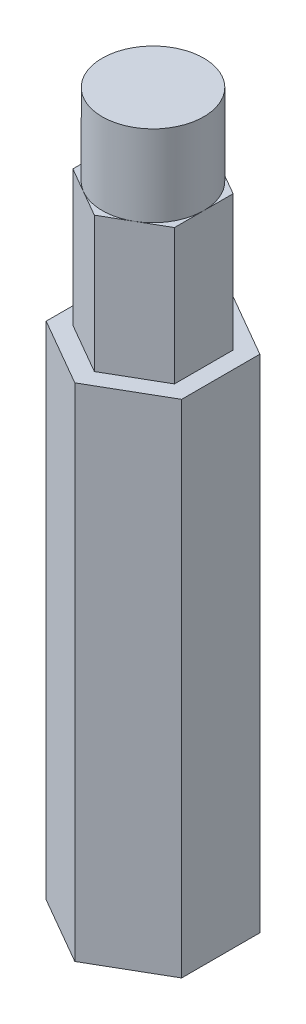
ISO-10303-21;
HEADER;
FILE_DESCRIPTION(('STEP AP214'),'2;1');
FILE_NAME('part.step','',(''),(''),'','','');
FILE_SCHEMA(('AUTOMOTIVE_DESIGN { 1 0 10303 214 1 1 1 1 }'));
ENDSEC;
DATA;
#1=APPLICATION_CONTEXT('core data for automotive mechanical design processes');
#2=APPLICATION_PROTOCOL_DEFINITION('international standard','automotive_design',2000,#1);
#3=PRODUCT_CONTEXT('',#1,'mechanical');
#4=PRODUCT('Part','Part','',(#3));
#5=PRODUCT_RELATED_PRODUCT_CATEGORY('part','',(#4));
#6=PRODUCT_DEFINITION_FORMATION('','',#4);
#7=PRODUCT_DEFINITION_CONTEXT('part definition',#1,'design');
#8=PRODUCT_DEFINITION('design','',#6,#7);
#9=PRODUCT_DEFINITION_SHAPE('','',#8);
#10=(LENGTH_UNIT() NAMED_UNIT(*) SI_UNIT(.MILLI.,.METRE.));
#11=(NAMED_UNIT(*) PLANE_ANGLE_UNIT() SI_UNIT($,.RADIAN.));
#12=(NAMED_UNIT(*) SI_UNIT($,.STERADIAN.) SOLID_ANGLE_UNIT());
#13=UNCERTAINTY_MEASURE_WITH_UNIT(LENGTH_MEASURE(1.E-05),#10,'distance_accuracy_value','');
#14=(GEOMETRIC_REPRESENTATION_CONTEXT(3) GLOBAL_UNCERTAINTY_ASSIGNED_CONTEXT((#13)) GLOBAL_UNIT_ASSIGNED_CONTEXT((#10,
#11,#12)) REPRESENTATION_CONTEXT('',''));
#15=CARTESIAN_POINT('',(0.,0.,0.));
#16=DIRECTION('',(0.,0.,1.));
#17=DIRECTION('',(1.,0.,0.));
#18=AXIS2_PLACEMENT_3D('',#15,#16,#17);
#19=CARTESIAN_POINT('',(0.,59.69,0.));
#20=DIRECTION('',(0.,1.,0.));
#21=DIRECTION('',(0.,0.,1.));
#22=AXIS2_PLACEMENT_3D('',#19,#20,#21);
#23=PLANE('',#22);
#24=DIRECTION('',(-0.866025403784439,0.,0.5));
#25=VECTOR('',#24,1.);
#26=CARTESIAN_POINT('',(0.,59.69,-5.49926131403119));
#27=LINE('',#26,#25);
#28=CARTESIAN_POINT('',(-2.38125,59.69,-4.12444598552339));
#29=VERTEX_POINT('',#28);
#30=CARTESIAN_POINT('',(-4.7625,59.69,-2.74963065701559));
#31=VERTEX_POINT('',#30);
#32=EDGE_CURVE('E187',#29,#31,#27,.T.);
#33=ORIENTED_EDGE('',*,*,#32,.T.);
#34=DIRECTION('',(0.,0.,1.));
#35=VECTOR('',#34,1.);
#36=CARTESIAN_POINT('',(-4.7625,59.69,-2.74963065701559));
#37=LINE('',#36,#35);
#38=CARTESIAN_POINT('',(-4.7625,59.69,0.));
#39=VERTEX_POINT('',#38);
#40=EDGE_CURVE('E192',#31,#39,#37,.T.);
#41=ORIENTED_EDGE('',*,*,#40,.T.);
#42=CARTESIAN_POINT('',(0.,59.69,0.));
#43=DIRECTION('',(0.,1.,0.));
#44=DIRECTION('',(0.,0.,1.));
#45=AXIS2_PLACEMENT_3D('',#42,#43,#44);
#46=CIRCLE('',#45,4.7625);
#47=EDGE_CURVE('E222',#39,#29,#46,.F.);
#48=ORIENTED_EDGE('',*,*,#47,.T.);
#49=EDGE_LOOP('',(#33,#41,#48));
#50=FACE_BOUND('',#49,.T.);
#51=ADVANCED_FACE('F33',(#50),#23,.T.);
#52=CARTESIAN_POINT('',(-2.38125,59.69,4.12444598552339));
#53=VERTEX_POINT('',#52);
#54=EDGE_CURVE('E218',#53,#39,#46,.F.);
#55=ORIENTED_EDGE('',*,*,#54,.T.);
#56=CARTESIAN_POINT('',(-4.7625,59.69,2.74963065701559));
#57=VERTEX_POINT('',#56);
#58=EDGE_CURVE('E191',#39,#57,#37,.T.);
#59=ORIENTED_EDGE('',*,*,#58,.T.);
#60=DIRECTION('',(0.866025403784439,0.,0.5));
#61=VECTOR('',#60,1.);
#62=CARTESIAN_POINT('',(-4.7625,59.69,2.74963065701559));
#63=LINE('',#62,#61);
#64=EDGE_CURVE('E165',#57,#53,#63,.T.);
#65=ORIENTED_EDGE('',*,*,#64,.T.);
#66=EDGE_LOOP('',(#55,#59,#65));
#67=FACE_BOUND('',#66,.T.);
#68=ADVANCED_FACE('F281',(#67),#23,.T.);
#69=CARTESIAN_POINT('',(2.38125,59.69,4.12444598552339));
#70=VERTEX_POINT('',#69);
#71=EDGE_CURVE('E217',#70,#53,#46,.F.);
#72=ORIENTED_EDGE('',*,*,#71,.T.);
#73=CARTESIAN_POINT('',(0.,59.69,5.49926131403119));
#74=VERTEX_POINT('',#73);
#75=EDGE_CURVE('E168',#53,#74,#63,.T.);
#76=ORIENTED_EDGE('',*,*,#75,.T.);
#77=DIRECTION('',(0.866025403784439,0.,-0.5));
#78=VECTOR('',#77,1.);
#79=CARTESIAN_POINT('',(0.,59.69,5.49926131403119));
#80=LINE('',#79,#78);
#81=EDGE_CURVE('E179',#74,#70,#80,.T.);
#82=ORIENTED_EDGE('',*,*,#81,.T.);
#83=EDGE_LOOP('',(#72,#76,#82));
#84=FACE_BOUND('',#83,.T.);
#85=ADVANCED_FACE('F288',(#84),#23,.T.);
#86=DIRECTION('',(-0.866025403784439,0.,-0.5));
#87=VECTOR('',#86,1.);
#88=CARTESIAN_POINT('',(4.7625,59.69,-2.7496306570156));
#89=LINE('',#88,#87);
#90=CARTESIAN_POINT('',(2.38125,59.69,-4.12444598552339));
#91=VERTEX_POINT('',#90);
#92=CARTESIAN_POINT('',(0.,59.69,-5.49926131403119));
#93=VERTEX_POINT('',#92);
#94=EDGE_CURVE('E185',#91,#93,#89,.T.);
#95=ORIENTED_EDGE('',*,*,#94,.T.);
#96=EDGE_CURVE('E188',#93,#29,#27,.T.);
#97=ORIENTED_EDGE('',*,*,#96,.T.);
#98=EDGE_CURVE('E318',#29,#91,#46,.F.);
#99=ORIENTED_EDGE('',*,*,#98,.T.);
#100=EDGE_LOOP('',(#95,#97,#99));
#101=FACE_BOUND('',#100,.T.);
#102=ADVANCED_FACE('F303',(#101),#23,.T.);
#103=CARTESIAN_POINT('',(4.7625,59.69,0.));
#104=VERTEX_POINT('',#103);
#105=EDGE_CURVE('E311',#104,#70,#46,.F.);
#106=ORIENTED_EDGE('',*,*,#105,.T.);
#107=CARTESIAN_POINT('',(4.7625,59.69,2.74963065701559));
#108=VERTEX_POINT('',#107);
#109=EDGE_CURVE('E183',#70,#108,#80,.T.);
#110=ORIENTED_EDGE('',*,*,#109,.T.);
#111=DIRECTION('',(0.,0.,-1.));
#112=VECTOR('',#111,1.);
#113=CARTESIAN_POINT('',(4.7625,59.69,2.74963065701559));
#114=LINE('',#113,#112);
#115=EDGE_CURVE('E145',#108,#104,#114,.T.);
#116=ORIENTED_EDGE('',*,*,#115,.T.);
#117=EDGE_LOOP('',(#106,#110,#116));
#118=FACE_BOUND('',#117,.T.);
#119=ADVANCED_FACE('F295',(#118),#23,.T.);
#120=CARTESIAN_POINT('',(4.7625,59.69,-2.7496306570156));
#121=VERTEX_POINT('',#120);
#122=EDGE_CURVE('E182',#104,#121,#114,.T.);
#123=ORIENTED_EDGE('',*,*,#122,.T.);
#124=EDGE_CURVE('E56',#121,#91,#89,.T.);
#125=ORIENTED_EDGE('',*,*,#124,.T.);
#126=EDGE_CURVE('E308',#91,#104,#46,.F.);
#127=ORIENTED_EDGE('',*,*,#126,.T.);
#128=EDGE_LOOP('',(#123,#125,#127));
#129=FACE_BOUND('',#128,.T.);
#130=ADVANCED_FACE('F284',(#129),#23,.T.);
#131=CARTESIAN_POINT('',(0.,67.31,0.));
#132=DIRECTION('',(0.,-1.,0.));
#133=DIRECTION('',(0.,0.,-1.));
#134=AXIS2_PLACEMENT_3D('',#131,#132,#133);
#135=CYLINDRICAL_SURFACE('',#134,4.7625);
#136=ORIENTED_EDGE('',*,*,#54,.F.);
#137=ORIENTED_EDGE('',*,*,#71,.F.);
#138=ORIENTED_EDGE('',*,*,#105,.F.);
#139=ORIENTED_EDGE('',*,*,#126,.F.);
#140=ORIENTED_EDGE('',*,*,#98,.F.);
#141=ORIENTED_EDGE('',*,*,#47,.F.);
#142=EDGE_LOOP('',(#136,#137,#138,#139,#140,#141));
#143=FACE_BOUND('',#142,.T.);
#144=CARTESIAN_POINT('',(0.,67.31,0.));
#145=DIRECTION('',(0.,1.,0.));
#146=DIRECTION('',(0.,0.,1.));
#147=AXIS2_PLACEMENT_3D('',#144,#145,#146);
#148=CIRCLE('',#147,4.7625);
#149=CARTESIAN_POINT('',(0.,67.31,4.7625));
#150=VERTEX_POINT('',#149);
#151=EDGE_CURVE('E214',#150,#150,#148,.T.);
#152=ORIENTED_EDGE('',*,*,#151,.F.);
#153=EDGE_LOOP('',(#152));
#154=FACE_BOUND('',#153,.T.);
#155=ADVANCED_FACE('F294',(#143,#154),#135,.T.);
#156=CARTESIAN_POINT('',(0.,67.31,0.));
#157=DIRECTION('',(0.,1.,0.));
#158=DIRECTION('',(0.,0.,1.));
#159=AXIS2_PLACEMENT_3D('',#156,#157,#158);
#160=PLANE('',#159);
#161=ORIENTED_EDGE('',*,*,#151,.T.);
#162=EDGE_LOOP('',(#161));
#163=FACE_BOUND('',#162,.T.);
#164=ADVANCED_FACE('F301',(#163),#160,.T.);
#165=CARTESIAN_POINT('',(0.,46.99,0.));
#166=DIRECTION('',(0.,1.,0.));
#167=DIRECTION('',(0.,0.,1.));
#168=AXIS2_PLACEMENT_3D('',#165,#166,#167);
#169=PLANE('',#168);
#170=DIRECTION('',(0.866025403784439,0.,0.5));
#171=VECTOR('',#170,1.);
#172=CARTESIAN_POINT('',(-4.7625,46.99,2.74963065701559));
#173=LINE('',#172,#171);
#174=CARTESIAN_POINT('',(-4.7625,46.99,2.74963065701559));
#175=VERTEX_POINT('',#174);
#176=CARTESIAN_POINT('',(0.,46.99,5.49926131403119));
#177=VERTEX_POINT('',#176);
#178=EDGE_CURVE('E150',#175,#177,#173,.T.);
#179=ORIENTED_EDGE('',*,*,#178,.F.);
#180=DIRECTION('',(0.,0.,1.));
#181=VECTOR('',#180,1.);
#182=CARTESIAN_POINT('',(-4.7625,46.99,-2.74963065701559));
#183=LINE('',#182,#181);
#184=CARTESIAN_POINT('',(-4.7625,46.99,-2.74963065701559));
#185=VERTEX_POINT('',#184);
#186=EDGE_CURVE('E175',#185,#175,#183,.T.);
#187=ORIENTED_EDGE('',*,*,#186,.F.);
#188=DIRECTION('',(-0.866025403784439,0.,0.5));
#189=VECTOR('',#188,1.);
#190=CARTESIAN_POINT('',(0.,46.99,-5.49926131403119));
#191=LINE('',#190,#189);
#192=CARTESIAN_POINT('',(0.,46.99,-5.49926131403119));
#193=VERTEX_POINT('',#192);
#194=EDGE_CURVE('E172',#193,#185,#191,.T.);
#195=ORIENTED_EDGE('',*,*,#194,.F.);
#196=DIRECTION('',(-0.866025403784439,0.,-0.5));
#197=VECTOR('',#196,1.);
#198=CARTESIAN_POINT('',(4.7625,46.99,-2.7496306570156));
#199=LINE('',#198,#197);
#200=CARTESIAN_POINT('',(4.7625,46.99,-2.7496306570156));
#201=VERTEX_POINT('',#200);
#202=EDGE_CURVE('E160',#201,#193,#199,.T.);
#203=ORIENTED_EDGE('',*,*,#202,.F.);
#204=DIRECTION('',(0.,0.,-1.));
#205=VECTOR('',#204,1.);
#206=CARTESIAN_POINT('',(4.7625,46.99,2.74963065701559));
#207=LINE('',#206,#205);
#208=CARTESIAN_POINT('',(4.7625,46.99,2.74963065701559));
#209=VERTEX_POINT('',#208);
#210=EDGE_CURVE('E143',#209,#201,#207,.T.);
#211=ORIENTED_EDGE('',*,*,#210,.F.);
#212=DIRECTION('',(0.866025403784439,0.,-0.5));
#213=VECTOR('',#212,1.);
#214=CARTESIAN_POINT('',(0.,46.99,5.49926131403119));
#215=LINE('',#214,#213);
#216=EDGE_CURVE('E156',#177,#209,#215,.T.);
#217=ORIENTED_EDGE('',*,*,#216,.F.);
#218=EDGE_LOOP('',(#179,#187,#195,#203,#211,#217));
#219=FACE_BOUND('',#218,.T.);
#220=DIRECTION('',(0.866025403784439,0.,0.5));
#221=VECTOR('',#220,1.);
#222=CARTESIAN_POINT('',(-6.35,46.99,3.66617420935412));
#223=LINE('',#222,#221);
#224=CARTESIAN_POINT('',(-6.35,46.99,3.66617420935412));
#225=VERTEX_POINT('',#224);
#226=CARTESIAN_POINT('',(0.,46.99,7.33234841870825));
#227=VERTEX_POINT('',#226);
#228=EDGE_CURVE('E196',#225,#227,#223,.T.);
#229=ORIENTED_EDGE('',*,*,#228,.T.);
#230=DIRECTION('',(0.866025403784438,0.,-0.5));
#231=VECTOR('',#230,1.);
#232=CARTESIAN_POINT('',(0.,46.99,7.33234841870825));
#233=LINE('',#232,#231);
#234=CARTESIAN_POINT('',(6.35,46.99,3.66617420935412));
#235=VERTEX_POINT('',#234);
#236=EDGE_CURVE('E205',#227,#235,#233,.T.);
#237=ORIENTED_EDGE('',*,*,#236,.T.);
#238=DIRECTION('',(0.,0.,-1.));
#239=VECTOR('',#238,1.);
#240=CARTESIAN_POINT('',(6.35,46.99,3.66617420935412));
#241=LINE('',#240,#239);
#242=CARTESIAN_POINT('',(6.35,46.99,-3.66617420935412));
#243=VERTEX_POINT('',#242);
#244=EDGE_CURVE('E207',#235,#243,#241,.T.);
#245=ORIENTED_EDGE('',*,*,#244,.T.);
#246=DIRECTION('',(-0.866025403784439,0.,-0.5));
#247=VECTOR('',#246,1.);
#248=CARTESIAN_POINT('',(6.35,46.99,-3.66617420935412));
#249=LINE('',#248,#247);
#250=CARTESIAN_POINT('',(0.,46.99,-7.33234841870825));
#251=VERTEX_POINT('',#250);
#252=EDGE_CURVE('E209',#243,#251,#249,.T.);
#253=ORIENTED_EDGE('',*,*,#252,.T.);
#254=DIRECTION('',(-0.866025403784438,0.,0.5));
#255=VECTOR('',#254,1.);
#256=CARTESIAN_POINT('',(0.,46.99,-7.33234841870825));
#257=LINE('',#256,#255);
#258=CARTESIAN_POINT('',(-6.35,46.99,-3.66617420935412));
#259=VERTEX_POINT('',#258);
#260=EDGE_CURVE('E211',#251,#259,#257,.T.);
#261=ORIENTED_EDGE('',*,*,#260,.T.);
#262=DIRECTION('',(0.,0.,1.));
#263=VECTOR('',#262,1.);
#264=CARTESIAN_POINT('',(-6.35,46.99,-3.66617420935412));
#265=LINE('',#264,#263);
#266=EDGE_CURVE('E48',#259,#225,#265,.T.);
#267=ORIENTED_EDGE('',*,*,#266,.T.);
#268=EDGE_LOOP('',(#229,#237,#245,#253,#261,#267));
#269=FACE_BOUND('',#268,.T.);
#270=ADVANCED_FACE('F155',(#219,#269),#169,.T.);
#271=CARTESIAN_POINT('',(0.,46.99,5.49926131403119));
#272=DIRECTION('',(0.5,0.,0.866025403784439));
#273=DIRECTION('',(0.866025403784439,0.,-0.5));
#274=AXIS2_PLACEMENT_3D('',#271,#272,#273);
#275=PLANE('',#274);
#276=ORIENTED_EDGE('',*,*,#81,.F.);
#277=DIRECTION('',(0.,1.,0.));
#278=VECTOR('',#277,1.);
#279=CARTESIAN_POINT('',(0.,46.99,5.49926131403119));
#280=LINE('',#279,#278);
#281=EDGE_CURVE('E164',#177,#74,#280,.T.);
#282=ORIENTED_EDGE('',*,*,#281,.F.);
#283=ORIENTED_EDGE('',*,*,#216,.T.);
#284=DIRECTION('',(0.,1.,0.));
#285=VECTOR('',#284,1.);
#286=CARTESIAN_POINT('',(4.7625,46.99,2.74963065701559));
#287=LINE('',#286,#285);
#288=EDGE_CURVE('E140',#209,#108,#287,.T.);
#289=ORIENTED_EDGE('',*,*,#288,.T.);
#290=ORIENTED_EDGE('',*,*,#109,.F.);
#291=EDGE_LOOP('',(#276,#282,#283,#289,#290));
#292=FACE_BOUND('',#291,.T.);
#293=ADVANCED_FACE('F163',(#292),#275,.T.);
#294=CARTESIAN_POINT('',(-4.7625,46.99,2.74963065701559));
#295=DIRECTION('',(-0.5,0.,0.866025403784439));
#296=DIRECTION('',(0.866025403784439,0.,0.5));
#297=AXIS2_PLACEMENT_3D('',#294,#295,#296);
#298=PLANE('',#297);
#299=ORIENTED_EDGE('',*,*,#64,.F.);
#300=DIRECTION('',(0.,1.,0.));
#301=VECTOR('',#300,1.);
#302=CARTESIAN_POINT('',(-4.7625,46.99,2.74963065701559));
#303=LINE('',#302,#301);
#304=EDGE_CURVE('E197',#175,#57,#303,.T.);
#305=ORIENTED_EDGE('',*,*,#304,.F.);
#306=ORIENTED_EDGE('',*,*,#178,.T.);
#307=ORIENTED_EDGE('',*,*,#281,.T.);
#308=ORIENTED_EDGE('',*,*,#75,.F.);
#309=EDGE_LOOP('',(#299,#305,#306,#307,#308));
#310=FACE_BOUND('',#309,.T.);
#311=ADVANCED_FACE('F326',(#310),#298,.T.);
#312=CARTESIAN_POINT('',(-4.7625,46.99,-2.74963065701559));
#313=DIRECTION('',(-1.,0.,0.));
#314=DIRECTION('',(0.,0.,1.));
#315=AXIS2_PLACEMENT_3D('',#312,#313,#314);
#316=PLANE('',#315);
#317=ORIENTED_EDGE('',*,*,#40,.F.);
#318=DIRECTION('',(0.,1.,0.));
#319=VECTOR('',#318,1.);
#320=CARTESIAN_POINT('',(-4.7625,46.99,-2.74963065701559));
#321=LINE('',#320,#319);
#322=EDGE_CURVE('E199',#185,#31,#321,.T.);
#323=ORIENTED_EDGE('',*,*,#322,.F.);
#324=ORIENTED_EDGE('',*,*,#186,.T.);
#325=ORIENTED_EDGE('',*,*,#304,.T.);
#326=ORIENTED_EDGE('',*,*,#58,.F.);
#327=EDGE_LOOP('',(#317,#323,#324,#325,#326));
#328=FACE_BOUND('',#327,.T.);
#329=ADVANCED_FACE('F330',(#328),#316,.T.);
#330=CARTESIAN_POINT('',(0.,46.99,-5.49926131403119));
#331=DIRECTION('',(-0.5,0.,-0.866025403784439));
#332=DIRECTION('',(-0.866025403784439,0.,0.5));
#333=AXIS2_PLACEMENT_3D('',#330,#331,#332);
#334=PLANE('',#333);
#335=ORIENTED_EDGE('',*,*,#96,.F.);
#336=DIRECTION('',(0.,1.,0.));
#337=VECTOR('',#336,1.);
#338=CARTESIAN_POINT('',(0.,46.99,-5.49926131403119));
#339=LINE('',#338,#337);
#340=EDGE_CURVE('E201',#193,#93,#339,.T.);
#341=ORIENTED_EDGE('',*,*,#340,.F.);
#342=ORIENTED_EDGE('',*,*,#194,.T.);
#343=ORIENTED_EDGE('',*,*,#322,.T.);
#344=ORIENTED_EDGE('',*,*,#32,.F.);
#345=EDGE_LOOP('',(#335,#341,#342,#343,#344));
#346=FACE_BOUND('',#345,.T.);
#347=ADVANCED_FACE('F333',(#346),#334,.T.);
#348=CARTESIAN_POINT('',(4.7625,46.99,-2.7496306570156));
#349=DIRECTION('',(0.5,0.,-0.866025403784439));
#350=DIRECTION('',(-0.866025403784439,0.,-0.5));
#351=AXIS2_PLACEMENT_3D('',#348,#349,#350);
#352=PLANE('',#351);
#353=ORIENTED_EDGE('',*,*,#124,.F.);
#354=DIRECTION('',(0.,1.,0.));
#355=VECTOR('',#354,1.);
#356=CARTESIAN_POINT('',(4.7625,46.99,-2.7496306570156));
#357=LINE('',#356,#355);
#358=EDGE_CURVE('E149',#201,#121,#357,.T.);
#359=ORIENTED_EDGE('',*,*,#358,.F.);
#360=ORIENTED_EDGE('',*,*,#202,.T.);
#361=ORIENTED_EDGE('',*,*,#340,.T.);
#362=ORIENTED_EDGE('',*,*,#94,.F.);
#363=EDGE_LOOP('',(#353,#359,#360,#361,#362));
#364=FACE_BOUND('',#363,.T.);
#365=ADVANCED_FACE('F334',(#364),#352,.T.);
#366=CARTESIAN_POINT('',(4.7625,46.99,2.74963065701559));
#367=DIRECTION('',(1.,0.,0.));
#368=DIRECTION('',(0.,0.,-1.));
#369=AXIS2_PLACEMENT_3D('',#366,#367,#368);
#370=PLANE('',#369);
#371=ORIENTED_EDGE('',*,*,#115,.F.);
#372=ORIENTED_EDGE('',*,*,#288,.F.);
#373=ORIENTED_EDGE('',*,*,#210,.T.);
#374=ORIENTED_EDGE('',*,*,#358,.T.);
#375=ORIENTED_EDGE('',*,*,#122,.F.);
#376=EDGE_LOOP('',(#371,#372,#373,#374,#375));
#377=FACE_BOUND('',#376,.T.);
#378=ADVANCED_FACE('F142',(#377),#370,.T.);
#379=CARTESIAN_POINT('',(0.,0.,0.));
#380=DIRECTION('',(0.,1.,0.));
#381=DIRECTION('',(0.,0.,1.));
#382=AXIS2_PLACEMENT_3D('',#379,#380,#381);
#383=PLANE('',#382);
#384=DIRECTION('',(0.866025403784438,0.,-0.5));
#385=VECTOR('',#384,1.);
#386=CARTESIAN_POINT('',(0.,0.,7.33234841870825));
#387=LINE('',#386,#385);
#388=CARTESIAN_POINT('',(0.,0.,7.33234841870825));
#389=VERTEX_POINT('',#388);
#390=CARTESIAN_POINT('',(6.35,0.,3.66617420935412));
#391=VERTEX_POINT('',#390);
#392=EDGE_CURVE('E221',#389,#391,#387,.T.);
#393=ORIENTED_EDGE('',*,*,#392,.F.);
#394=DIRECTION('',(0.866025403784439,0.,0.5));
#395=VECTOR('',#394,1.);
#396=CARTESIAN_POINT('',(-6.35,0.,3.66617420935412));
#397=LINE('',#396,#395);
#398=CARTESIAN_POINT('',(-6.35,0.,3.66617420935412));
#399=VERTEX_POINT('',#398);
#400=EDGE_CURVE('E237',#399,#389,#397,.T.);
#401=ORIENTED_EDGE('',*,*,#400,.F.);
#402=DIRECTION('',(0.,0.,1.));
#403=VECTOR('',#402,1.);
#404=CARTESIAN_POINT('',(-6.35,0.,-3.66617420935412));
#405=LINE('',#404,#403);
#406=CARTESIAN_POINT('',(-6.35,0.,-3.66617420935412));
#407=VERTEX_POINT('',#406);
#408=EDGE_CURVE('E234',#407,#399,#405,.T.);
#409=ORIENTED_EDGE('',*,*,#408,.F.);
#410=DIRECTION('',(-0.866025403784438,0.,0.5));
#411=VECTOR('',#410,1.);
#412=CARTESIAN_POINT('',(0.,0.,-7.33234841870825));
#413=LINE('',#412,#411);
#414=CARTESIAN_POINT('',(0.,0.,-7.33234841870825));
#415=VERTEX_POINT('',#414);
#416=EDGE_CURVE('E231',#415,#407,#413,.T.);
#417=ORIENTED_EDGE('',*,*,#416,.F.);
#418=DIRECTION('',(-0.866025403784439,0.,-0.5));
#419=VECTOR('',#418,1.);
#420=CARTESIAN_POINT('',(6.35,0.,-3.66617420935412));
#421=LINE('',#420,#419);
#422=CARTESIAN_POINT('',(6.35,0.,-3.66617420935412));
#423=VERTEX_POINT('',#422);
#424=EDGE_CURVE('E228',#423,#415,#421,.T.);
#425=ORIENTED_EDGE('',*,*,#424,.F.);
#426=DIRECTION('',(0.,0.,-1.));
#427=VECTOR('',#426,1.);
#428=CARTESIAN_POINT('',(6.35,0.,3.66617420935412));
#429=LINE('',#428,#427);
#430=EDGE_CURVE('E225',#391,#423,#429,.T.);
#431=ORIENTED_EDGE('',*,*,#430,.F.);
#432=EDGE_LOOP('',(#393,#401,#409,#417,#425,#431));
#433=FACE_BOUND('',#432,.T.);
#434=ADVANCED_FACE('F261',(#433),#383,.F.);
#435=CARTESIAN_POINT('',(-6.35,59.69,3.66617420935412));
#436=DIRECTION('',(0.5,0.,-0.866025403784439));
#437=DIRECTION('',(-0.866025403784439,0.,-0.5));
#438=AXIS2_PLACEMENT_3D('',#435,#436,#437);
#439=PLANE('',#438);
#440=ORIENTED_EDGE('',*,*,#228,.F.);
#441=DIRECTION('',(0.,-1.,0.));
#442=VECTOR('',#441,1.);
#443=CARTESIAN_POINT('',(-6.35,59.69,3.66617420935412));
#444=LINE('',#443,#442);
#445=EDGE_CURVE('E242',#225,#399,#444,.T.);
#446=ORIENTED_EDGE('',*,*,#445,.T.);
#447=ORIENTED_EDGE('',*,*,#400,.T.);
#448=DIRECTION('',(0.,-1.,0.));
#449=VECTOR('',#448,1.);
#450=CARTESIAN_POINT('',(0.,59.69,7.33234841870825));
#451=LINE('',#450,#449);
#452=EDGE_CURVE('E240',#227,#389,#451,.T.);
#453=ORIENTED_EDGE('',*,*,#452,.F.);
#454=EDGE_LOOP('',(#440,#446,#447,#453));
#455=FACE_BOUND('',#454,.T.);
#456=ADVANCED_FACE('F272',(#455),#439,.F.);
#457=CARTESIAN_POINT('',(-6.35,59.69,-3.66617420935412));
#458=DIRECTION('',(1.,0.,0.));
#459=DIRECTION('',(0.,0.,-1.));
#460=AXIS2_PLACEMENT_3D('',#457,#458,#459);
#461=PLANE('',#460);
#462=ORIENTED_EDGE('',*,*,#266,.F.);
#463=DIRECTION('',(0.,-1.,0.));
#464=VECTOR('',#463,1.);
#465=CARTESIAN_POINT('',(-6.35,59.69,-3.66617420935412));
#466=LINE('',#465,#464);
#467=EDGE_CURVE('E244',#259,#407,#466,.T.);
#468=ORIENTED_EDGE('',*,*,#467,.T.);
#469=ORIENTED_EDGE('',*,*,#408,.T.);
#470=ORIENTED_EDGE('',*,*,#445,.F.);
#471=EDGE_LOOP('',(#462,#468,#469,#470));
#472=FACE_BOUND('',#471,.T.);
#473=ADVANCED_FACE('F270',(#472),#461,.F.);
#474=CARTESIAN_POINT('',(0.,59.69,-7.33234841870825));
#475=DIRECTION('',(0.5,0.,0.866025403784438));
#476=DIRECTION('',(0.866025403784439,0.,-0.5));
#477=AXIS2_PLACEMENT_3D('',#474,#475,#476);
#478=PLANE('',#477);
#479=ORIENTED_EDGE('',*,*,#260,.F.);
#480=DIRECTION('',(0.,-1.,0.));
#481=VECTOR('',#480,1.);
#482=CARTESIAN_POINT('',(0.,59.69,-7.33234841870825));
#483=LINE('',#482,#481);
#484=EDGE_CURVE('E246',#251,#415,#483,.T.);
#485=ORIENTED_EDGE('',*,*,#484,.T.);
#486=ORIENTED_EDGE('',*,*,#416,.T.);
#487=ORIENTED_EDGE('',*,*,#467,.F.);
#488=EDGE_LOOP('',(#479,#485,#486,#487));
#489=FACE_BOUND('',#488,.T.);
#490=ADVANCED_FACE('F267',(#489),#478,.F.);
#491=CARTESIAN_POINT('',(6.35,59.69,-3.66617420935412));
#492=DIRECTION('',(-0.5,0.,0.866025403784439));
#493=DIRECTION('',(0.866025403784439,0.,0.5));
#494=AXIS2_PLACEMENT_3D('',#491,#492,#493);
#495=PLANE('',#494);
#496=ORIENTED_EDGE('',*,*,#252,.F.);
#497=DIRECTION('',(0.,-1.,0.));
#498=VECTOR('',#497,1.);
#499=CARTESIAN_POINT('',(6.35,59.69,-3.66617420935412));
#500=LINE('',#499,#498);
#501=EDGE_CURVE('E41',#243,#423,#500,.T.);
#502=ORIENTED_EDGE('',*,*,#501,.T.);
#503=ORIENTED_EDGE('',*,*,#424,.T.);
#504=ORIENTED_EDGE('',*,*,#484,.F.);
#505=EDGE_LOOP('',(#496,#502,#503,#504));
#506=FACE_BOUND('',#505,.T.);
#507=ADVANCED_FACE('F250',(#506),#495,.F.);
#508=CARTESIAN_POINT('',(6.35,59.69,3.66617420935412));
#509=DIRECTION('',(-1.,0.,0.));
#510=DIRECTION('',(0.,0.,1.));
#511=AXIS2_PLACEMENT_3D('',#508,#509,#510);
#512=PLANE('',#511);
#513=ORIENTED_EDGE('',*,*,#244,.F.);
#514=DIRECTION('',(0.,-1.,0.));
#515=VECTOR('',#514,1.);
#516=CARTESIAN_POINT('',(6.35,59.69,3.66617420935412));
#517=LINE('',#516,#515);
#518=EDGE_CURVE('E11',#235,#391,#517,.T.);
#519=ORIENTED_EDGE('',*,*,#518,.T.);
#520=ORIENTED_EDGE('',*,*,#430,.T.);
#521=ORIENTED_EDGE('',*,*,#501,.F.);
#522=EDGE_LOOP('',(#513,#519,#520,#521));
#523=FACE_BOUND('',#522,.T.);
#524=ADVANCED_FACE('F257',(#523),#512,.F.);
#525=CARTESIAN_POINT('',(0.,59.69,7.33234841870825));
#526=DIRECTION('',(-0.5,0.,-0.866025403784438));
#527=DIRECTION('',(-0.866025403784439,0.,0.5));
#528=AXIS2_PLACEMENT_3D('',#525,#526,#527);
#529=PLANE('',#528);
#530=ORIENTED_EDGE('',*,*,#236,.F.);
#531=ORIENTED_EDGE('',*,*,#452,.T.);
#532=ORIENTED_EDGE('',*,*,#392,.T.);
#533=ORIENTED_EDGE('',*,*,#518,.F.);
#534=EDGE_LOOP('',(#530,#531,#532,#533));
#535=FACE_BOUND('',#534,.T.);
#536=ADVANCED_FACE('F35',(#535),#529,.F.);
#537=CLOSED_SHELL('',(#51,#68,#85,#102,#119,#130,#155,#164,#270,#293,#311,#329,#347,#365,#378,
#434,#456,#473,#490,#507,#524,#536));
#538=MANIFOLD_SOLID_BREP('B2',#537);
#539=ADVANCED_BREP_SHAPE_REPRESENTATION('',(#18,#538),#14);
#540=SHAPE_DEFINITION_REPRESENTATION(#9,#539);
ENDSEC;
END-ISO-10303-21;
